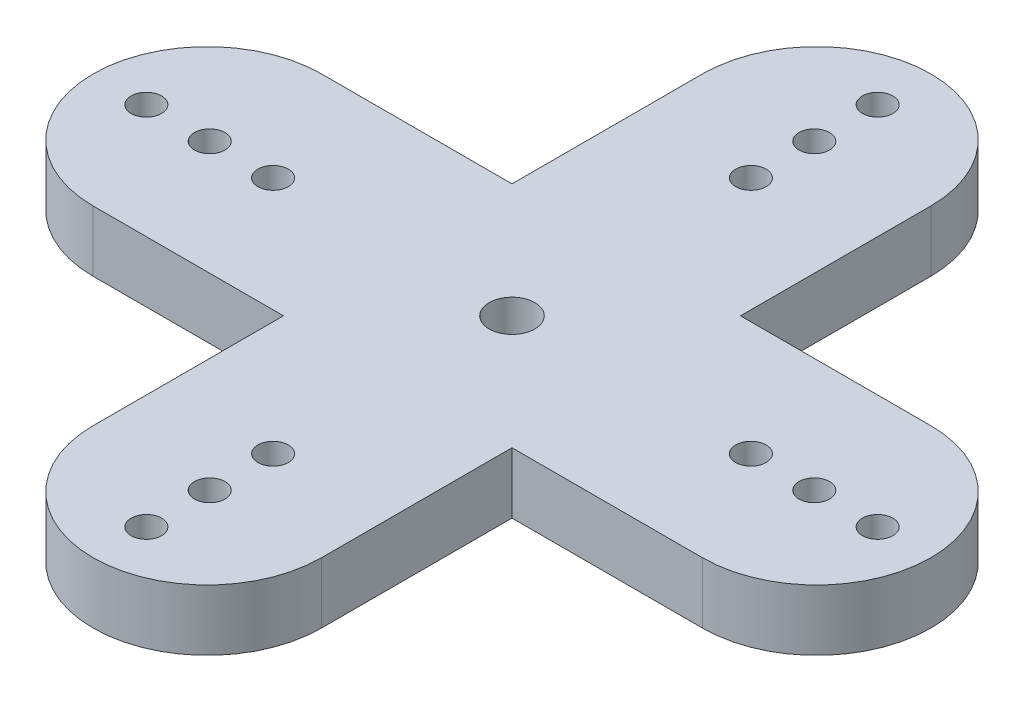
ISO-10303-21;
HEADER;
FILE_DESCRIPTION(('STEP AP214'),'2;1');
FILE_NAME('part.step','',(''),(''),'','','');
FILE_SCHEMA(('AUTOMOTIVE_DESIGN { 1 0 10303 214 1 1 1 1 }'));
ENDSEC;
DATA;
#1=APPLICATION_CONTEXT('core data for automotive mechanical design processes');
#2=APPLICATION_PROTOCOL_DEFINITION('international standard','automotive_design',2000,#1);
#3=PRODUCT_CONTEXT('',#1,'mechanical');
#4=PRODUCT('Part','Part','',(#3));
#5=PRODUCT_RELATED_PRODUCT_CATEGORY('part','',(#4));
#6=PRODUCT_DEFINITION_FORMATION('','',#4);
#7=PRODUCT_DEFINITION_CONTEXT('part definition',#1,'design');
#8=PRODUCT_DEFINITION('design','',#6,#7);
#9=PRODUCT_DEFINITION_SHAPE('','',#8);
#10=(LENGTH_UNIT() NAMED_UNIT(*) SI_UNIT(.MILLI.,.METRE.));
#11=(NAMED_UNIT(*) PLANE_ANGLE_UNIT() SI_UNIT($,.RADIAN.));
#12=(NAMED_UNIT(*) SI_UNIT($,.STERADIAN.) SOLID_ANGLE_UNIT());
#13=UNCERTAINTY_MEASURE_WITH_UNIT(LENGTH_MEASURE(1.E-05),#10,'distance_accuracy_value','');
#14=(GEOMETRIC_REPRESENTATION_CONTEXT(3) GLOBAL_UNCERTAINTY_ASSIGNED_CONTEXT((#13)) GLOBAL_UNIT_ASSIGNED_CONTEXT((#10,
#11,#12)) REPRESENTATION_CONTEXT('',''));
#15=CARTESIAN_POINT('',(0.,0.,0.));
#16=DIRECTION('',(0.,0.,1.));
#17=DIRECTION('',(1.,0.,0.));
#18=AXIS2_PLACEMENT_3D('',#15,#16,#17);
#19=CARTESIAN_POINT('',(0.,3.175,-15.875));
#20=DIRECTION('',(0.,-1.,0.));
#21=DIRECTION('',(0.,0.,-1.));
#22=AXIS2_PLACEMENT_3D('',#19,#20,#21);
#23=PLANE('',#22);
#24=CARTESIAN_POINT('',(-1.64951544372305E-13,3.175,15.748));
#25=DIRECTION('',(0.,1.,0.));
#26=DIRECTION('',(0.,0.,1.));
#27=AXIS2_PLACEMENT_3D('',#24,#25,#26);
#28=CIRCLE('',#27,0.793749999999999);
#29=CARTESIAN_POINT('',(-1.64951544372305E-13,3.175,16.54175));
#30=VERTEX_POINT('',#29);
#31=EDGE_CURVE('E326',#30,#30,#28,.T.);
#32=ORIENTED_EDGE('',*,*,#31,.F.);
#33=EDGE_LOOP('',(#32));
#34=FACE_BOUND('',#33,.T.);
#35=CARTESIAN_POINT('',(12.446,3.175,0.));
#36=DIRECTION('',(0.,1.,0.));
#37=DIRECTION('',(0.,0.,1.));
#38=AXIS2_PLACEMENT_3D('',#35,#36,#37);
#39=CIRCLE('',#38,0.79375);
#40=CARTESIAN_POINT('',(12.446,3.175,0.793750000000087));
#41=VERTEX_POINT('',#40);
#42=EDGE_CURVE('E338',#41,#41,#39,.T.);
#43=ORIENTED_EDGE('',*,*,#42,.F.);
#44=EDGE_LOOP('',(#43));
#45=FACE_BOUND('',#44,.T.);
#46=CARTESIAN_POINT('',(19.05,3.175,1.33025439009923E-13));
#47=DIRECTION('',(0.,1.,0.));
#48=DIRECTION('',(0.,0.,1.));
#49=AXIS2_PLACEMENT_3D('',#46,#47,#48);
#50=CIRCLE('',#49,0.793749999999998);
#51=CARTESIAN_POINT('',(19.05,3.175,0.793750000000131));
#52=VERTEX_POINT('',#51);
#53=EDGE_CURVE('E350',#52,#52,#50,.T.);
#54=ORIENTED_EDGE('',*,*,#53,.F.);
#55=EDGE_LOOP('',(#54));
#56=FACE_BOUND('',#55,.T.);
#57=CARTESIAN_POINT('',(0.,3.175,-15.748));
#58=DIRECTION('',(0.,1.,0.));
#59=DIRECTION('',(0.,0.,1.));
#60=AXIS2_PLACEMENT_3D('',#57,#58,#59);
#61=CIRCLE('',#60,0.793749999999999);
#62=CARTESIAN_POINT('',(0.,3.175,-14.95425));
#63=VERTEX_POINT('',#62);
#64=EDGE_CURVE('E362',#63,#63,#61,.T.);
#65=ORIENTED_EDGE('',*,*,#64,.F.);
#66=EDGE_LOOP('',(#65));
#67=FACE_BOUND('',#66,.T.);
#68=CARTESIAN_POINT('',(-12.446,3.175,0.));
#69=DIRECTION('',(0.,1.,0.));
#70=DIRECTION('',(0.,0.,1.));
#71=AXIS2_PLACEMENT_3D('',#68,#69,#70);
#72=CIRCLE('',#71,0.793749999999999);
#73=CARTESIAN_POINT('',(-12.446,3.175,0.793749999999999));
#74=VERTEX_POINT('',#73);
#75=EDGE_CURVE('E374',#74,#74,#72,.T.);
#76=ORIENTED_EDGE('',*,*,#75,.F.);
#77=EDGE_LOOP('',(#76));
#78=FACE_BOUND('',#77,.T.);
#79=CARTESIAN_POINT('',(0.,3.175,0.));
#80=DIRECTION('',(0.,1.,0.));
#81=DIRECTION('',(0.,0.,1.));
#82=AXIS2_PLACEMENT_3D('',#79,#80,#81);
#83=CIRCLE('',#82,1.190625);
#84=CARTESIAN_POINT('',(0.,3.175,1.190625));
#85=VERTEX_POINT('',#84);
#86=EDGE_CURVE('E386',#85,#85,#83,.T.);
#87=ORIENTED_EDGE('',*,*,#86,.F.);
#88=EDGE_LOOP('',(#87));
#89=FACE_BOUND('',#88,.T.);
#90=CARTESIAN_POINT('',(0.,3.175,-15.875));
#91=DIRECTION('',(0.,1.,0.));
#92=DIRECTION('',(0.,0.,-1.));
#93=AXIS2_PLACEMENT_3D('',#90,#91,#92);
#94=CIRCLE('',#93,5.953125);
#95=CARTESIAN_POINT('',(5.953125,3.175,-15.875));
#96=VERTEX_POINT('',#95);
#97=CARTESIAN_POINT('',(-5.953125,3.175,-15.875));
#98=VERTEX_POINT('',#97);
#99=EDGE_CURVE('E175',#96,#98,#94,.T.);
#100=ORIENTED_EDGE('',*,*,#99,.T.);
#101=DIRECTION('',(0.,0.,1.));
#102=VECTOR('',#101,1.);
#103=CARTESIAN_POINT('',(-5.953125,3.175,-15.875));
#104=LINE('',#103,#102);
#105=CARTESIAN_POINT('',(-5.953125,3.175,-5.95212500000002));
#106=VERTEX_POINT('',#105);
#107=EDGE_CURVE('E103',#98,#106,#104,.T.);
#108=ORIENTED_EDGE('',*,*,#107,.T.);
#109=DIRECTION('',(-1.,0.,0.));
#110=VECTOR('',#109,1.);
#111=CARTESIAN_POINT('',(-5.953125,3.175,-5.95212500000002));
#112=LINE('',#111,#110);
#113=CARTESIAN_POINT('',(-15.874,3.175,-5.95212500000006));
#114=VERTEX_POINT('',#113);
#115=EDGE_CURVE('E202',#106,#114,#112,.T.);
#116=ORIENTED_EDGE('',*,*,#115,.T.);
#117=CARTESIAN_POINT('',(-15.874,3.175,0.000999999999942813));
#118=DIRECTION('',(0.,1.,0.));
#119=DIRECTION('',(0.,0.,1.));
#120=AXIS2_PLACEMENT_3D('',#117,#118,#119);
#121=CIRCLE('',#120,5.953125);
#122=CARTESIAN_POINT('',(-15.874,3.175,5.95412499999994));
#123=VERTEX_POINT('',#122);
#124=EDGE_CURVE('E221',#114,#123,#121,.T.);
#125=ORIENTED_EDGE('',*,*,#124,.T.);
#126=DIRECTION('',(1.,0.,0.));
#127=VECTOR('',#126,1.);
#128=CARTESIAN_POINT('',(-5.953125,3.175,5.95412499999998));
#129=LINE('',#128,#127);
#130=CARTESIAN_POINT('',(-5.953125,3.175,5.95412499999998));
#131=VERTEX_POINT('',#130);
#132=EDGE_CURVE('E218',#123,#131,#129,.T.);
#133=ORIENTED_EDGE('',*,*,#132,.T.);
#134=DIRECTION('',(0.,0.,1.));
#135=VECTOR('',#134,1.);
#136=CARTESIAN_POINT('',(-5.953125,3.175,5.95412499999998));
#137=LINE('',#136,#135);
#138=CARTESIAN_POINT('',(-5.953125,3.175,15.875));
#139=VERTEX_POINT('',#138);
#140=EDGE_CURVE('E220',#131,#139,#137,.T.);
#141=ORIENTED_EDGE('',*,*,#140,.T.);
#142=CARTESIAN_POINT('',(0.,3.175,15.875));
#143=DIRECTION('',(0.,1.,0.));
#144=DIRECTION('',(0.,0.,1.));
#145=AXIS2_PLACEMENT_3D('',#142,#143,#144);
#146=CIRCLE('',#145,5.953125);
#147=CARTESIAN_POINT('',(5.953125,3.175,15.875));
#148=VERTEX_POINT('',#147);
#149=EDGE_CURVE('E223',#139,#148,#146,.T.);
#150=ORIENTED_EDGE('',*,*,#149,.T.);
#151=DIRECTION('',(0.,0.,-1.));
#152=VECTOR('',#151,1.);
#153=CARTESIAN_POINT('',(5.953125,3.175,5.95412500000002));
#154=LINE('',#153,#152);
#155=CARTESIAN_POINT('',(5.953125,3.175,5.95412500000002));
#156=VERTEX_POINT('',#155);
#157=EDGE_CURVE('E229',#148,#156,#154,.T.);
#158=ORIENTED_EDGE('',*,*,#157,.T.);
#159=DIRECTION('',(1.,0.,0.));
#160=VECTOR('',#159,1.);
#161=CARTESIAN_POINT('',(15.876,3.175,5.95412500000006));
#162=LINE('',#161,#160);
#163=CARTESIAN_POINT('',(15.876,3.175,5.95412500000006));
#164=VERTEX_POINT('',#163);
#165=EDGE_CURVE('E134',#156,#164,#162,.T.);
#166=ORIENTED_EDGE('',*,*,#165,.T.);
#167=CARTESIAN_POINT('',(15.876,3.175,0.00100000000005367));
#168=DIRECTION('',(0.,1.,0.));
#169=DIRECTION('',(0.,0.,-1.));
#170=AXIS2_PLACEMENT_3D('',#167,#168,#169);
#171=CIRCLE('',#170,5.953125);
#172=CARTESIAN_POINT('',(15.876,3.175,-5.95212499999995));
#173=VERTEX_POINT('',#172);
#174=EDGE_CURVE('E128',#164,#173,#171,.T.);
#175=ORIENTED_EDGE('',*,*,#174,.T.);
#176=DIRECTION('',(-1.,0.,0.));
#177=VECTOR('',#176,1.);
#178=CARTESIAN_POINT('',(15.876,3.175,-5.95212499999995));
#179=LINE('',#178,#177);
#180=CARTESIAN_POINT('',(5.953125,3.175,-5.95212499999998));
#181=VERTEX_POINT('',#180);
#182=EDGE_CURVE('E132',#173,#181,#179,.T.);
#183=ORIENTED_EDGE('',*,*,#182,.T.);
#184=DIRECTION('',(0.,0.,-1.));
#185=VECTOR('',#184,1.);
#186=CARTESIAN_POINT('',(5.953125,3.175,-15.875));
#187=LINE('',#186,#185);
#188=EDGE_CURVE('E48',#181,#96,#187,.T.);
#189=ORIENTED_EDGE('',*,*,#188,.T.);
#190=EDGE_LOOP('',(#100,#108,#116,#125,#133,#141,#150,#158,#166,#175,#183,#189));
#191=FACE_BOUND('',#190,.T.);
#192=CARTESIAN_POINT('',(-19.05,3.175,0.));
#193=DIRECTION('',(0.,1.,0.));
#194=DIRECTION('',(0.,0.,1.));
#195=AXIS2_PLACEMENT_3D('',#192,#193,#194);
#196=CIRCLE('',#195,0.793749999999999);
#197=CARTESIAN_POINT('',(-19.05,3.175,0.793749999999999));
#198=VERTEX_POINT('',#197);
#199=EDGE_CURVE('E156',#198,#198,#196,.T.);
#200=ORIENTED_EDGE('',*,*,#199,.F.);
#201=EDGE_LOOP('',(#200));
#202=FACE_BOUND('',#201,.T.);
#203=CARTESIAN_POINT('',(-15.748,3.175,0.));
#204=DIRECTION('',(0.,1.,0.));
#205=DIRECTION('',(0.,0.,1.));
#206=AXIS2_PLACEMENT_3D('',#203,#204,#205);
#207=CIRCLE('',#206,0.793749999999999);
#208=CARTESIAN_POINT('',(-15.748,3.175,0.793749999999999));
#209=VERTEX_POINT('',#208);
#210=EDGE_CURVE('E380',#209,#209,#207,.T.);
#211=ORIENTED_EDGE('',*,*,#210,.F.);
#212=EDGE_LOOP('',(#211));
#213=FACE_BOUND('',#212,.T.);
#214=CARTESIAN_POINT('',(0.,3.175,-19.05));
#215=DIRECTION('',(0.,1.,0.));
#216=DIRECTION('',(0.,0.,1.));
#217=AXIS2_PLACEMENT_3D('',#214,#215,#216);
#218=CIRCLE('',#217,0.793749999999999);
#219=CARTESIAN_POINT('',(0.,3.175,-18.25625));
#220=VERTEX_POINT('',#219);
#221=EDGE_CURVE('E368',#220,#220,#218,.T.);
#222=ORIENTED_EDGE('',*,*,#221,.F.);
#223=EDGE_LOOP('',(#222));
#224=FACE_BOUND('',#223,.T.);
#225=CARTESIAN_POINT('',(0.,3.175,-12.446));
#226=DIRECTION('',(0.,1.,0.));
#227=DIRECTION('',(0.,0.,1.));
#228=AXIS2_PLACEMENT_3D('',#225,#226,#227);
#229=CIRCLE('',#228,0.793749999999999);
#230=CARTESIAN_POINT('',(0.,3.175,-11.65225));
#231=VERTEX_POINT('',#230);
#232=EDGE_CURVE('E356',#231,#231,#229,.T.);
#233=ORIENTED_EDGE('',*,*,#232,.F.);
#234=EDGE_LOOP('',(#233));
#235=FACE_BOUND('',#234,.T.);
#236=CARTESIAN_POINT('',(15.748,3.175,1.09967696248203E-13));
#237=DIRECTION('',(0.,1.,0.));
#238=DIRECTION('',(0.,0.,1.));
#239=AXIS2_PLACEMENT_3D('',#236,#237,#238);
#240=CIRCLE('',#239,0.79375);
#241=CARTESIAN_POINT('',(15.748,3.175,0.79375000000011));
#242=VERTEX_POINT('',#241);
#243=EDGE_CURVE('E344',#242,#242,#240,.T.);
#244=ORIENTED_EDGE('',*,*,#243,.F.);
#245=EDGE_LOOP('',(#244));
#246=FACE_BOUND('',#245,.T.);
#247=CARTESIAN_POINT('',(-1.99538158514885E-13,3.175,19.05));
#248=DIRECTION('',(0.,1.,0.));
#249=DIRECTION('',(0.,0.,1.));
#250=AXIS2_PLACEMENT_3D('',#247,#248,#249);
#251=CIRCLE('',#250,0.79375);
#252=CARTESIAN_POINT('',(-1.99538158514885E-13,3.175,19.84375));
#253=VERTEX_POINT('',#252);
#254=EDGE_CURVE('E332',#253,#253,#251,.T.);
#255=ORIENTED_EDGE('',*,*,#254,.F.);
#256=EDGE_LOOP('',(#255));
#257=FACE_BOUND('',#256,.T.);
#258=CARTESIAN_POINT('',(-1.30364930229725E-13,3.175,12.446));
#259=DIRECTION('',(0.,1.,0.));
#260=DIRECTION('',(0.,0.,1.));
#261=AXIS2_PLACEMENT_3D('',#258,#259,#260);
#262=CIRCLE('',#261,0.793749999999999);
#263=CARTESIAN_POINT('',(-1.30364930229725E-13,3.175,13.23975));
#264=VERTEX_POINT('',#263);
#265=EDGE_CURVE('E317',#264,#264,#262,.T.);
#266=ORIENTED_EDGE('',*,*,#265,.F.);
#267=EDGE_LOOP('',(#266));
#268=FACE_BOUND('',#267,.T.);
#269=ADVANCED_FACE('F31',(#34,#45,#56,#67,#78,#89,#191,#202,#213,#224,#235,#246,#257,#268),#23,.F.);
#270=CARTESIAN_POINT('',(0.,0.,-15.875));
#271=DIRECTION('',(0.,-1.,0.));
#272=DIRECTION('',(0.,0.,-1.));
#273=AXIS2_PLACEMENT_3D('',#270,#271,#272);
#274=PLANE('',#273);
#275=CARTESIAN_POINT('',(-1.64951544372305E-13,0.,15.748));
#276=DIRECTION('',(0.,1.,0.));
#277=DIRECTION('',(0.,0.,1.));
#278=AXIS2_PLACEMENT_3D('',#275,#276,#277);
#279=CIRCLE('',#278,0.793749999999999);
#280=CARTESIAN_POINT('',(-1.64951544372305E-13,0.,16.54175));
#281=VERTEX_POINT('',#280);
#282=EDGE_CURVE('E323',#281,#281,#279,.T.);
#283=ORIENTED_EDGE('',*,*,#282,.T.);
#284=EDGE_LOOP('',(#283));
#285=FACE_BOUND('',#284,.T.);
#286=CARTESIAN_POINT('',(12.446,0.,0.));
#287=DIRECTION('',(0.,1.,0.));
#288=DIRECTION('',(0.,0.,1.));
#289=AXIS2_PLACEMENT_3D('',#286,#287,#288);
#290=CIRCLE('',#289,0.79375);
#291=CARTESIAN_POINT('',(12.446,0.,0.793750000000087));
#292=VERTEX_POINT('',#291);
#293=EDGE_CURVE('E335',#292,#292,#290,.T.);
#294=ORIENTED_EDGE('',*,*,#293,.T.);
#295=EDGE_LOOP('',(#294));
#296=FACE_BOUND('',#295,.T.);
#297=CARTESIAN_POINT('',(19.05,0.,1.33025439009923E-13));
#298=DIRECTION('',(0.,1.,0.));
#299=DIRECTION('',(0.,0.,1.));
#300=AXIS2_PLACEMENT_3D('',#297,#298,#299);
#301=CIRCLE('',#300,0.793749999999998);
#302=CARTESIAN_POINT('',(19.05,0.,0.793750000000131));
#303=VERTEX_POINT('',#302);
#304=EDGE_CURVE('E347',#303,#303,#301,.T.);
#305=ORIENTED_EDGE('',*,*,#304,.T.);
#306=EDGE_LOOP('',(#305));
#307=FACE_BOUND('',#306,.T.);
#308=CARTESIAN_POINT('',(0.,0.,-15.748));
#309=DIRECTION('',(0.,1.,0.));
#310=DIRECTION('',(0.,0.,1.));
#311=AXIS2_PLACEMENT_3D('',#308,#309,#310);
#312=CIRCLE('',#311,0.793749999999999);
#313=CARTESIAN_POINT('',(0.,0.,-14.95425));
#314=VERTEX_POINT('',#313);
#315=EDGE_CURVE('E359',#314,#314,#312,.T.);
#316=ORIENTED_EDGE('',*,*,#315,.T.);
#317=EDGE_LOOP('',(#316));
#318=FACE_BOUND('',#317,.T.);
#319=CARTESIAN_POINT('',(-12.446,0.,0.));
#320=DIRECTION('',(0.,1.,0.));
#321=DIRECTION('',(0.,0.,1.));
#322=AXIS2_PLACEMENT_3D('',#319,#320,#321);
#323=CIRCLE('',#322,0.793749999999999);
#324=CARTESIAN_POINT('',(-12.446,0.,0.793749999999999));
#325=VERTEX_POINT('',#324);
#326=EDGE_CURVE('E371',#325,#325,#323,.T.);
#327=ORIENTED_EDGE('',*,*,#326,.T.);
#328=EDGE_LOOP('',(#327));
#329=FACE_BOUND('',#328,.T.);
#330=CARTESIAN_POINT('',(0.,0.,0.));
#331=DIRECTION('',(0.,1.,0.));
#332=DIRECTION('',(0.,0.,1.));
#333=AXIS2_PLACEMENT_3D('',#330,#331,#332);
#334=CIRCLE('',#333,1.190625);
#335=CARTESIAN_POINT('',(0.,0.,1.190625));
#336=VERTEX_POINT('',#335);
#337=EDGE_CURVE('E383',#336,#336,#334,.T.);
#338=ORIENTED_EDGE('',*,*,#337,.T.);
#339=EDGE_LOOP('',(#338));
#340=FACE_BOUND('',#339,.T.);
#341=CARTESIAN_POINT('',(0.,0.,-15.875));
#342=DIRECTION('',(0.,1.,0.));
#343=DIRECTION('',(0.,0.,-1.));
#344=AXIS2_PLACEMENT_3D('',#341,#342,#343);
#345=CIRCLE('',#344,5.953125);
#346=CARTESIAN_POINT('',(5.953125,0.,-15.875));
#347=VERTEX_POINT('',#346);
#348=CARTESIAN_POINT('',(-5.953125,0.,-15.875));
#349=VERTEX_POINT('',#348);
#350=EDGE_CURVE('E152',#347,#349,#345,.T.);
#351=ORIENTED_EDGE('',*,*,#350,.F.);
#352=DIRECTION('',(0.,0.,-1.));
#353=VECTOR('',#352,1.);
#354=CARTESIAN_POINT('',(5.953125,0.,-15.875));
#355=LINE('',#354,#353);
#356=CARTESIAN_POINT('',(5.953125,0.,-5.95212499999998));
#357=VERTEX_POINT('',#356);
#358=EDGE_CURVE('E95',#357,#347,#355,.T.);
#359=ORIENTED_EDGE('',*,*,#358,.F.);
#360=DIRECTION('',(-1.,0.,0.));
#361=VECTOR('',#360,1.);
#362=CARTESIAN_POINT('',(15.876,0.,-5.95212499999995));
#363=LINE('',#362,#361);
#364=CARTESIAN_POINT('',(15.876,0.,-5.95212499999995));
#365=VERTEX_POINT('',#364);
#366=EDGE_CURVE('E89',#365,#357,#363,.T.);
#367=ORIENTED_EDGE('',*,*,#366,.F.);
#368=CARTESIAN_POINT('',(15.876,0.,0.00100000000005367));
#369=DIRECTION('',(0.,1.,0.));
#370=DIRECTION('',(0.,0.,-1.));
#371=AXIS2_PLACEMENT_3D('',#368,#369,#370);
#372=CIRCLE('',#371,5.953125);
#373=CARTESIAN_POINT('',(15.876,0.,5.95412500000006));
#374=VERTEX_POINT('',#373);
#375=EDGE_CURVE('E142',#374,#365,#372,.T.);
#376=ORIENTED_EDGE('',*,*,#375,.F.);
#377=DIRECTION('',(1.,0.,0.));
#378=VECTOR('',#377,1.);
#379=CARTESIAN_POINT('',(15.876,0.,5.95412500000006));
#380=LINE('',#379,#378);
#381=CARTESIAN_POINT('',(5.953125,0.,5.95412500000002));
#382=VERTEX_POINT('',#381);
#383=EDGE_CURVE('E170',#382,#374,#380,.T.);
#384=ORIENTED_EDGE('',*,*,#383,.F.);
#385=DIRECTION('',(0.,0.,-1.));
#386=VECTOR('',#385,1.);
#387=CARTESIAN_POINT('',(5.953125,0.,5.95412500000002));
#388=LINE('',#387,#386);
#389=CARTESIAN_POINT('',(5.953125,0.,15.875));
#390=VERTEX_POINT('',#389);
#391=EDGE_CURVE('E168',#390,#382,#388,.T.);
#392=ORIENTED_EDGE('',*,*,#391,.F.);
#393=CARTESIAN_POINT('',(0.,0.,15.875));
#394=DIRECTION('',(0.,1.,0.));
#395=DIRECTION('',(0.,0.,1.));
#396=AXIS2_PLACEMENT_3D('',#393,#394,#395);
#397=CIRCLE('',#396,5.953125);
#398=CARTESIAN_POINT('',(-5.953125,0.,15.875));
#399=VERTEX_POINT('',#398);
#400=EDGE_CURVE('E166',#399,#390,#397,.T.);
#401=ORIENTED_EDGE('',*,*,#400,.F.);
#402=DIRECTION('',(0.,0.,1.));
#403=VECTOR('',#402,1.);
#404=CARTESIAN_POINT('',(-5.953125,0.,5.95412499999998));
#405=LINE('',#404,#403);
#406=CARTESIAN_POINT('',(-5.953125,0.,5.95412499999998));
#407=VERTEX_POINT('',#406);
#408=EDGE_CURVE('E164',#407,#399,#405,.T.);
#409=ORIENTED_EDGE('',*,*,#408,.F.);
#410=DIRECTION('',(1.,0.,0.));
#411=VECTOR('',#410,1.);
#412=CARTESIAN_POINT('',(-5.953125,0.,5.95412499999998));
#413=LINE('',#412,#411);
#414=CARTESIAN_POINT('',(-15.874,0.,5.95412499999994));
#415=VERTEX_POINT('',#414);
#416=EDGE_CURVE('E162',#415,#407,#413,.T.);
#417=ORIENTED_EDGE('',*,*,#416,.F.);
#418=CARTESIAN_POINT('',(-15.874,0.,0.000999999999942813));
#419=DIRECTION('',(0.,1.,0.));
#420=DIRECTION('',(0.,0.,1.));
#421=AXIS2_PLACEMENT_3D('',#418,#419,#420);
#422=CIRCLE('',#421,5.953125);
#423=CARTESIAN_POINT('',(-15.874,0.,-5.95212500000006));
#424=VERTEX_POINT('',#423);
#425=EDGE_CURVE('E160',#424,#415,#422,.T.);
#426=ORIENTED_EDGE('',*,*,#425,.F.);
#427=DIRECTION('',(-1.,0.,0.));
#428=VECTOR('',#427,1.);
#429=CARTESIAN_POINT('',(-5.953125,0.,-5.95212500000002));
#430=LINE('',#429,#428);
#431=CARTESIAN_POINT('',(-5.953125,0.,-5.95212500000002));
#432=VERTEX_POINT('',#431);
#433=EDGE_CURVE('E158',#432,#424,#430,.T.);
#434=ORIENTED_EDGE('',*,*,#433,.F.);
#435=DIRECTION('',(0.,0.,1.));
#436=VECTOR('',#435,1.);
#437=CARTESIAN_POINT('',(-5.953125,0.,-15.875));
#438=LINE('',#437,#436);
#439=EDGE_CURVE('E155',#349,#432,#438,.T.);
#440=ORIENTED_EDGE('',*,*,#439,.F.);
#441=EDGE_LOOP('',(#351,#359,#367,#376,#384,#392,#401,#409,#417,#426,#434,#440));
#442=FACE_BOUND('',#441,.T.);
#443=CARTESIAN_POINT('',(-19.05,0.,0.));
#444=DIRECTION('',(0.,1.,0.));
#445=DIRECTION('',(0.,0.,1.));
#446=AXIS2_PLACEMENT_3D('',#443,#444,#445);
#447=CIRCLE('',#446,0.793749999999999);
#448=CARTESIAN_POINT('',(-19.05,0.,0.793749999999999));
#449=VERTEX_POINT('',#448);
#450=EDGE_CURVE('E389',#449,#449,#447,.T.);
#451=ORIENTED_EDGE('',*,*,#450,.T.);
#452=EDGE_LOOP('',(#451));
#453=FACE_BOUND('',#452,.T.);
#454=CARTESIAN_POINT('',(-15.748,0.,0.));
#455=DIRECTION('',(0.,1.,0.));
#456=DIRECTION('',(0.,0.,1.));
#457=AXIS2_PLACEMENT_3D('',#454,#455,#456);
#458=CIRCLE('',#457,0.793749999999999);
#459=CARTESIAN_POINT('',(-15.748,0.,0.793749999999999));
#460=VERTEX_POINT('',#459);
#461=EDGE_CURVE('E377',#460,#460,#458,.T.);
#462=ORIENTED_EDGE('',*,*,#461,.T.);
#463=EDGE_LOOP('',(#462));
#464=FACE_BOUND('',#463,.T.);
#465=CARTESIAN_POINT('',(0.,0.,-19.05));
#466=DIRECTION('',(0.,1.,0.));
#467=DIRECTION('',(0.,0.,1.));
#468=AXIS2_PLACEMENT_3D('',#465,#466,#467);
#469=CIRCLE('',#468,0.793749999999999);
#470=CARTESIAN_POINT('',(0.,0.,-18.25625));
#471=VERTEX_POINT('',#470);
#472=EDGE_CURVE('E365',#471,#471,#469,.T.);
#473=ORIENTED_EDGE('',*,*,#472,.T.);
#474=EDGE_LOOP('',(#473));
#475=FACE_BOUND('',#474,.T.);
#476=CARTESIAN_POINT('',(0.,0.,-12.446));
#477=DIRECTION('',(0.,1.,0.));
#478=DIRECTION('',(0.,0.,1.));
#479=AXIS2_PLACEMENT_3D('',#476,#477,#478);
#480=CIRCLE('',#479,0.793749999999999);
#481=CARTESIAN_POINT('',(0.,0.,-11.65225));
#482=VERTEX_POINT('',#481);
#483=EDGE_CURVE('E353',#482,#482,#480,.T.);
#484=ORIENTED_EDGE('',*,*,#483,.T.);
#485=EDGE_LOOP('',(#484));
#486=FACE_BOUND('',#485,.T.);
#487=CARTESIAN_POINT('',(15.748,0.,1.09967696248203E-13));
#488=DIRECTION('',(0.,1.,0.));
#489=DIRECTION('',(0.,0.,1.));
#490=AXIS2_PLACEMENT_3D('',#487,#488,#489);
#491=CIRCLE('',#490,0.79375);
#492=CARTESIAN_POINT('',(15.748,0.,0.79375000000011));
#493=VERTEX_POINT('',#492);
#494=EDGE_CURVE('E341',#493,#493,#491,.T.);
#495=ORIENTED_EDGE('',*,*,#494,.T.);
#496=EDGE_LOOP('',(#495));
#497=FACE_BOUND('',#496,.T.);
#498=CARTESIAN_POINT('',(-1.99538158514885E-13,0.,19.05));
#499=DIRECTION('',(0.,1.,0.));
#500=DIRECTION('',(0.,0.,1.));
#501=AXIS2_PLACEMENT_3D('',#498,#499,#500);
#502=CIRCLE('',#501,0.79375);
#503=CARTESIAN_POINT('',(-1.99538158514885E-13,0.,19.84375));
#504=VERTEX_POINT('',#503);
#505=EDGE_CURVE('E329',#504,#504,#502,.T.);
#506=ORIENTED_EDGE('',*,*,#505,.T.);
#507=EDGE_LOOP('',(#506));
#508=FACE_BOUND('',#507,.T.);
#509=CARTESIAN_POINT('',(-1.30364930229725E-13,0.,12.446));
#510=DIRECTION('',(0.,1.,0.));
#511=DIRECTION('',(0.,0.,1.));
#512=AXIS2_PLACEMENT_3D('',#509,#510,#511);
#513=CIRCLE('',#512,0.793749999999999);
#514=CARTESIAN_POINT('',(-1.30364930229725E-13,0.,13.23975));
#515=VERTEX_POINT('',#514);
#516=EDGE_CURVE('E320',#515,#515,#513,.T.);
#517=ORIENTED_EDGE('',*,*,#516,.T.);
#518=EDGE_LOOP('',(#517));
#519=FACE_BOUND('',#518,.T.);
#520=ADVANCED_FACE('F206',(#285,#296,#307,#318,#329,#340,#442,#453,#464,#475,#486,#497,#508,
#519),#274,.T.);
#521=CARTESIAN_POINT('',(0.,3.175,-15.875));
#522=DIRECTION('',(0.,-1.,0.));
#523=DIRECTION('',(0.,0.,-1.));
#524=AXIS2_PLACEMENT_3D('',#521,#522,#523);
#525=CYLINDRICAL_SURFACE('',#524,5.953125);
#526=ORIENTED_EDGE('',*,*,#350,.T.);
#527=DIRECTION('',(0.,-1.,0.));
#528=VECTOR('',#527,1.);
#529=CARTESIAN_POINT('',(-5.953125,3.175,-15.875));
#530=LINE('',#529,#528);
#531=EDGE_CURVE('E11',#98,#349,#530,.T.);
#532=ORIENTED_EDGE('',*,*,#531,.F.);
#533=ORIENTED_EDGE('',*,*,#99,.F.);
#534=DIRECTION('',(0.,-1.,0.));
#535=VECTOR('',#534,1.);
#536=CARTESIAN_POINT('',(5.953125,3.175,-15.875));
#537=LINE('',#536,#535);
#538=EDGE_CURVE('E148',#96,#347,#537,.T.);
#539=ORIENTED_EDGE('',*,*,#538,.T.);
#540=EDGE_LOOP('',(#526,#532,#533,#539));
#541=FACE_BOUND('',#540,.T.);
#542=ADVANCED_FACE('F33',(#541),#525,.T.);
#543=CARTESIAN_POINT('',(-5.953125,3.175,-15.875));
#544=DIRECTION('',(1.,0.,0.));
#545=DIRECTION('',(0.,0.,-1.));
#546=AXIS2_PLACEMENT_3D('',#543,#544,#545);
#547=PLANE('',#546);
#548=ORIENTED_EDGE('',*,*,#439,.T.);
#549=DIRECTION('',(0.,-1.,0.));
#550=VECTOR('',#549,1.);
#551=CARTESIAN_POINT('',(-5.953125,3.175,-5.95212500000002));
#552=LINE('',#551,#550);
#553=EDGE_CURVE('E40',#106,#432,#552,.T.);
#554=ORIENTED_EDGE('',*,*,#553,.F.);
#555=ORIENTED_EDGE('',*,*,#107,.F.);
#556=ORIENTED_EDGE('',*,*,#531,.T.);
#557=EDGE_LOOP('',(#548,#554,#555,#556));
#558=FACE_BOUND('',#557,.T.);
#559=ADVANCED_FACE('F579',(#558),#547,.F.);
#560=CARTESIAN_POINT('',(-5.953125,3.175,-5.95212500000002));
#561=DIRECTION('',(0.,0.,1.));
#562=DIRECTION('',(1.,0.,0.));
#563=AXIS2_PLACEMENT_3D('',#560,#561,#562);
#564=PLANE('',#563);
#565=ORIENTED_EDGE('',*,*,#433,.T.);
#566=DIRECTION('',(0.,-1.,0.));
#567=VECTOR('',#566,1.);
#568=CARTESIAN_POINT('',(-15.874,3.175,-5.95212500000006));
#569=LINE('',#568,#567);
#570=EDGE_CURVE('E194',#114,#424,#569,.T.);
#571=ORIENTED_EDGE('',*,*,#570,.F.);
#572=ORIENTED_EDGE('',*,*,#115,.F.);
#573=ORIENTED_EDGE('',*,*,#553,.T.);
#574=EDGE_LOOP('',(#565,#571,#572,#573));
#575=FACE_BOUND('',#574,.T.);
#576=ADVANCED_FACE('F200',(#575),#564,.F.);
#577=CARTESIAN_POINT('',(-15.874,3.175,0.000999999999942813));
#578=DIRECTION('',(0.,-1.,0.));
#579=DIRECTION('',(0.,0.,-1.));
#580=AXIS2_PLACEMENT_3D('',#577,#578,#579);
#581=CYLINDRICAL_SURFACE('',#580,5.953125);
#582=ORIENTED_EDGE('',*,*,#425,.T.);
#583=DIRECTION('',(0.,-1.,0.));
#584=VECTOR('',#583,1.);
#585=CARTESIAN_POINT('',(-15.874,3.175,5.95412499999994));
#586=LINE('',#585,#584);
#587=EDGE_CURVE('E191',#123,#415,#586,.T.);
#588=ORIENTED_EDGE('',*,*,#587,.F.);
#589=ORIENTED_EDGE('',*,*,#124,.F.);
#590=ORIENTED_EDGE('',*,*,#570,.T.);
#591=EDGE_LOOP('',(#582,#588,#589,#590));
#592=FACE_BOUND('',#591,.T.);
#593=ADVANCED_FACE('F212',(#592),#581,.T.);
#594=CARTESIAN_POINT('',(-5.953125,3.175,5.95412499999998));
#595=DIRECTION('',(0.,0.,-1.));
#596=DIRECTION('',(-1.,0.,0.));
#597=AXIS2_PLACEMENT_3D('',#594,#595,#596);
#598=PLANE('',#597);
#599=ORIENTED_EDGE('',*,*,#416,.T.);
#600=DIRECTION('',(0.,-1.,0.));
#601=VECTOR('',#600,1.);
#602=CARTESIAN_POINT('',(-5.953125,3.175,5.95412499999998));
#603=LINE('',#602,#601);
#604=EDGE_CURVE('E188',#131,#407,#603,.T.);
#605=ORIENTED_EDGE('',*,*,#604,.F.);
#606=ORIENTED_EDGE('',*,*,#132,.F.);
#607=ORIENTED_EDGE('',*,*,#587,.T.);
#608=EDGE_LOOP('',(#599,#605,#606,#607));
#609=FACE_BOUND('',#608,.T.);
#610=ADVANCED_FACE('F216',(#609),#598,.F.);
#611=CARTESIAN_POINT('',(-5.953125,3.175,5.95412499999998));
#612=DIRECTION('',(1.,0.,0.));
#613=DIRECTION('',(0.,0.,-1.));
#614=AXIS2_PLACEMENT_3D('',#611,#612,#613);
#615=PLANE('',#614);
#616=ORIENTED_EDGE('',*,*,#408,.T.);
#617=DIRECTION('',(0.,-1.,0.));
#618=VECTOR('',#617,1.);
#619=CARTESIAN_POINT('',(-5.953125,3.175,15.875));
#620=LINE('',#619,#618);
#621=EDGE_CURVE('E185',#139,#399,#620,.T.);
#622=ORIENTED_EDGE('',*,*,#621,.F.);
#623=ORIENTED_EDGE('',*,*,#140,.F.);
#624=ORIENTED_EDGE('',*,*,#604,.T.);
#625=EDGE_LOOP('',(#616,#622,#623,#624));
#626=FACE_BOUND('',#625,.T.);
#627=ADVANCED_FACE('F544',(#626),#615,.F.);
#628=CARTESIAN_POINT('',(0.,3.175,15.875));
#629=DIRECTION('',(0.,-1.,0.));
#630=DIRECTION('',(0.,0.,-1.));
#631=AXIS2_PLACEMENT_3D('',#628,#629,#630);
#632=CYLINDRICAL_SURFACE('',#631,5.953125);
#633=ORIENTED_EDGE('',*,*,#400,.T.);
#634=DIRECTION('',(0.,-1.,0.));
#635=VECTOR('',#634,1.);
#636=CARTESIAN_POINT('',(5.953125,3.175,15.875));
#637=LINE('',#636,#635);
#638=EDGE_CURVE('E182',#148,#390,#637,.T.);
#639=ORIENTED_EDGE('',*,*,#638,.F.);
#640=ORIENTED_EDGE('',*,*,#149,.F.);
#641=ORIENTED_EDGE('',*,*,#621,.T.);
#642=EDGE_LOOP('',(#633,#639,#640,#641));
#643=FACE_BOUND('',#642,.T.);
#644=ADVANCED_FACE('F535',(#643),#632,.T.);
#645=CARTESIAN_POINT('',(5.953125,3.175,5.95412500000002));
#646=DIRECTION('',(-1.,0.,0.));
#647=DIRECTION('',(0.,0.,1.));
#648=AXIS2_PLACEMENT_3D('',#645,#646,#647);
#649=PLANE('',#648);
#650=ORIENTED_EDGE('',*,*,#391,.T.);
#651=DIRECTION('',(0.,-1.,0.));
#652=VECTOR('',#651,1.);
#653=CARTESIAN_POINT('',(5.953125,3.175,5.95412500000002));
#654=LINE('',#653,#652);
#655=EDGE_CURVE('E179',#156,#382,#654,.T.);
#656=ORIENTED_EDGE('',*,*,#655,.F.);
#657=ORIENTED_EDGE('',*,*,#157,.F.);
#658=ORIENTED_EDGE('',*,*,#638,.T.);
#659=EDGE_LOOP('',(#650,#656,#657,#658));
#660=FACE_BOUND('',#659,.T.);
#661=ADVANCED_FACE('F235',(#660),#649,.F.);
#662=CARTESIAN_POINT('',(15.876,3.175,5.95412500000006));
#663=DIRECTION('',(0.,0.,-1.));
#664=DIRECTION('',(-1.,0.,0.));
#665=AXIS2_PLACEMENT_3D('',#662,#663,#664);
#666=PLANE('',#665);
#667=ORIENTED_EDGE('',*,*,#383,.T.);
#668=DIRECTION('',(0.,-1.,0.));
#669=VECTOR('',#668,1.);
#670=CARTESIAN_POINT('',(15.876,3.175,5.95412500000006));
#671=LINE('',#670,#669);
#672=EDGE_CURVE('E143',#164,#374,#671,.T.);
#673=ORIENTED_EDGE('',*,*,#672,.F.);
#674=ORIENTED_EDGE('',*,*,#165,.F.);
#675=ORIENTED_EDGE('',*,*,#655,.T.);
#676=EDGE_LOOP('',(#667,#673,#674,#675));
#677=FACE_BOUND('',#676,.T.);
#678=ADVANCED_FACE('F239',(#677),#666,.F.);
#679=CARTESIAN_POINT('',(15.876,3.175,0.00100000000005367));
#680=DIRECTION('',(0.,-1.,0.));
#681=DIRECTION('',(0.,0.,-1.));
#682=AXIS2_PLACEMENT_3D('',#679,#680,#681);
#683=CYLINDRICAL_SURFACE('',#682,5.953125);
#684=ORIENTED_EDGE('',*,*,#375,.T.);
#685=DIRECTION('',(0.,-1.,0.));
#686=VECTOR('',#685,1.);
#687=CARTESIAN_POINT('',(15.876,3.175,-5.95212499999995));
#688=LINE('',#687,#686);
#689=EDGE_CURVE('E139',#173,#365,#688,.T.);
#690=ORIENTED_EDGE('',*,*,#689,.F.);
#691=ORIENTED_EDGE('',*,*,#174,.F.);
#692=ORIENTED_EDGE('',*,*,#672,.T.);
#693=EDGE_LOOP('',(#684,#690,#691,#692));
#694=FACE_BOUND('',#693,.T.);
#695=ADVANCED_FACE('F140',(#694),#683,.T.);
#696=CARTESIAN_POINT('',(15.876,3.175,-5.95212499999995));
#697=DIRECTION('',(0.,0.,1.));
#698=DIRECTION('',(1.,0.,0.));
#699=AXIS2_PLACEMENT_3D('',#696,#697,#698);
#700=PLANE('',#699);
#701=ORIENTED_EDGE('',*,*,#366,.T.);
#702=DIRECTION('',(0.,-1.,0.));
#703=VECTOR('',#702,1.);
#704=CARTESIAN_POINT('',(5.953125,3.175,-5.95212499999998));
#705=LINE('',#704,#703);
#706=EDGE_CURVE('E144',#181,#357,#705,.T.);
#707=ORIENTED_EDGE('',*,*,#706,.F.);
#708=ORIENTED_EDGE('',*,*,#182,.F.);
#709=ORIENTED_EDGE('',*,*,#689,.T.);
#710=EDGE_LOOP('',(#701,#707,#708,#709));
#711=FACE_BOUND('',#710,.T.);
#712=ADVANCED_FACE('F146',(#711),#700,.F.);
#713=CARTESIAN_POINT('',(5.953125,3.175,-15.875));
#714=DIRECTION('',(-1.,0.,0.));
#715=DIRECTION('',(0.,0.,1.));
#716=AXIS2_PLACEMENT_3D('',#713,#714,#715);
#717=PLANE('',#716);
#718=ORIENTED_EDGE('',*,*,#358,.T.);
#719=ORIENTED_EDGE('',*,*,#538,.F.);
#720=ORIENTED_EDGE('',*,*,#188,.F.);
#721=ORIENTED_EDGE('',*,*,#706,.T.);
#722=EDGE_LOOP('',(#718,#719,#720,#721));
#723=FACE_BOUND('',#722,.T.);
#724=ADVANCED_FACE('F243',(#723),#717,.F.);
#725=CARTESIAN_POINT('',(-19.05,3.175,0.));
#726=DIRECTION('',(0.,-1.,0.));
#727=DIRECTION('',(0.,0.,-1.));
#728=AXIS2_PLACEMENT_3D('',#725,#726,#727);
#729=CYLINDRICAL_SURFACE('',#728,0.793749999999999);
#730=ORIENTED_EDGE('',*,*,#199,.T.);
#731=EDGE_LOOP('',(#730));
#732=FACE_BOUND('',#731,.T.);
#733=ORIENTED_EDGE('',*,*,#450,.F.);
#734=EDGE_LOOP('',(#733));
#735=FACE_BOUND('',#734,.T.);
#736=ADVANCED_FACE('F245',(#732,#735),#729,.F.);
#737=CARTESIAN_POINT('',(0.,3.175,0.));
#738=DIRECTION('',(0.,-1.,0.));
#739=DIRECTION('',(0.,0.,-1.));
#740=AXIS2_PLACEMENT_3D('',#737,#738,#739);
#741=CYLINDRICAL_SURFACE('',#740,1.190625);
#742=ORIENTED_EDGE('',*,*,#86,.T.);
#743=EDGE_LOOP('',(#742));
#744=FACE_BOUND('',#743,.T.);
#745=ORIENTED_EDGE('',*,*,#337,.F.);
#746=EDGE_LOOP('',(#745));
#747=FACE_BOUND('',#746,.T.);
#748=ADVANCED_FACE('F251',(#744,#747),#741,.F.);
#749=CARTESIAN_POINT('',(-15.748,3.175,0.));
#750=DIRECTION('',(0.,-1.,0.));
#751=DIRECTION('',(0.,0.,-1.));
#752=AXIS2_PLACEMENT_3D('',#749,#750,#751);
#753=CYLINDRICAL_SURFACE('',#752,0.793749999999999);
#754=ORIENTED_EDGE('',*,*,#210,.T.);
#755=EDGE_LOOP('',(#754));
#756=FACE_BOUND('',#755,.T.);
#757=ORIENTED_EDGE('',*,*,#461,.F.);
#758=EDGE_LOOP('',(#757));
#759=FACE_BOUND('',#758,.T.);
#760=ADVANCED_FACE('F268',(#756,#759),#753,.F.);
#761=CARTESIAN_POINT('',(-12.446,3.175,0.));
#762=DIRECTION('',(0.,-1.,0.));
#763=DIRECTION('',(0.,0.,-1.));
#764=AXIS2_PLACEMENT_3D('',#761,#762,#763);
#765=CYLINDRICAL_SURFACE('',#764,0.793749999999999);
#766=ORIENTED_EDGE('',*,*,#75,.T.);
#767=EDGE_LOOP('',(#766));
#768=FACE_BOUND('',#767,.T.);
#769=ORIENTED_EDGE('',*,*,#326,.F.);
#770=EDGE_LOOP('',(#769));
#771=FACE_BOUND('',#770,.T.);
#772=ADVANCED_FACE('F272',(#768,#771),#765,.F.);
#773=CARTESIAN_POINT('',(0.,3.175,-19.05));
#774=DIRECTION('',(0.,-1.,0.));
#775=DIRECTION('',(0.,0.,-1.));
#776=AXIS2_PLACEMENT_3D('',#773,#774,#775);
#777=CYLINDRICAL_SURFACE('',#776,0.793749999999999);
#778=ORIENTED_EDGE('',*,*,#221,.T.);
#779=EDGE_LOOP('',(#778));
#780=FACE_BOUND('',#779,.T.);
#781=ORIENTED_EDGE('',*,*,#472,.F.);
#782=EDGE_LOOP('',(#781));
#783=FACE_BOUND('',#782,.T.);
#784=ADVANCED_FACE('F276',(#780,#783),#777,.F.);
#785=CARTESIAN_POINT('',(0.,3.175,-15.748));
#786=DIRECTION('',(0.,-1.,0.));
#787=DIRECTION('',(0.,0.,-1.));
#788=AXIS2_PLACEMENT_3D('',#785,#786,#787);
#789=CYLINDRICAL_SURFACE('',#788,0.793749999999999);
#790=ORIENTED_EDGE('',*,*,#64,.T.);
#791=EDGE_LOOP('',(#790));
#792=FACE_BOUND('',#791,.T.);
#793=ORIENTED_EDGE('',*,*,#315,.F.);
#794=EDGE_LOOP('',(#793));
#795=FACE_BOUND('',#794,.T.);
#796=ADVANCED_FACE('F280',(#792,#795),#789,.F.);
#797=CARTESIAN_POINT('',(0.,3.175,-12.446));
#798=DIRECTION('',(0.,-1.,0.));
#799=DIRECTION('',(0.,0.,-1.));
#800=AXIS2_PLACEMENT_3D('',#797,#798,#799);
#801=CYLINDRICAL_SURFACE('',#800,0.793749999999999);
#802=ORIENTED_EDGE('',*,*,#232,.T.);
#803=EDGE_LOOP('',(#802));
#804=FACE_BOUND('',#803,.T.);
#805=ORIENTED_EDGE('',*,*,#483,.F.);
#806=EDGE_LOOP('',(#805));
#807=FACE_BOUND('',#806,.T.);
#808=ADVANCED_FACE('F284',(#804,#807),#801,.F.);
#809=CARTESIAN_POINT('',(19.05,3.175,1.33025439009923E-13));
#810=DIRECTION('',(0.,-1.,0.));
#811=DIRECTION('',(0.,0.,-1.));
#812=AXIS2_PLACEMENT_3D('',#809,#810,#811);
#813=CYLINDRICAL_SURFACE('',#812,0.793749999999998);
#814=ORIENTED_EDGE('',*,*,#53,.T.);
#815=EDGE_LOOP('',(#814));
#816=FACE_BOUND('',#815,.T.);
#817=ORIENTED_EDGE('',*,*,#304,.F.);
#818=EDGE_LOOP('',(#817));
#819=FACE_BOUND('',#818,.T.);
#820=ADVANCED_FACE('F288',(#816,#819),#813,.F.);
#821=CARTESIAN_POINT('',(15.748,3.175,1.09967696248203E-13));
#822=DIRECTION('',(0.,-1.,0.));
#823=DIRECTION('',(0.,0.,-1.));
#824=AXIS2_PLACEMENT_3D('',#821,#822,#823);
#825=CYLINDRICAL_SURFACE('',#824,0.79375);
#826=ORIENTED_EDGE('',*,*,#243,.T.);
#827=EDGE_LOOP('',(#826));
#828=FACE_BOUND('',#827,.T.);
#829=ORIENTED_EDGE('',*,*,#494,.F.);
#830=EDGE_LOOP('',(#829));
#831=FACE_BOUND('',#830,.T.);
#832=ADVANCED_FACE('F292',(#828,#831),#825,.F.);
#833=CARTESIAN_POINT('',(12.446,3.175,0.));
#834=DIRECTION('',(0.,-1.,0.));
#835=DIRECTION('',(0.,0.,-1.));
#836=AXIS2_PLACEMENT_3D('',#833,#834,#835);
#837=CYLINDRICAL_SURFACE('',#836,0.79375);
#838=ORIENTED_EDGE('',*,*,#42,.T.);
#839=EDGE_LOOP('',(#838));
#840=FACE_BOUND('',#839,.T.);
#841=ORIENTED_EDGE('',*,*,#293,.F.);
#842=EDGE_LOOP('',(#841));
#843=FACE_BOUND('',#842,.T.);
#844=ADVANCED_FACE('F296',(#840,#843),#837,.F.);
#845=CARTESIAN_POINT('',(-1.99538158514885E-13,3.175,19.05));
#846=DIRECTION('',(0.,-1.,0.));
#847=DIRECTION('',(0.,0.,-1.));
#848=AXIS2_PLACEMENT_3D('',#845,#846,#847);
#849=CYLINDRICAL_SURFACE('',#848,0.79375);
#850=ORIENTED_EDGE('',*,*,#254,.T.);
#851=EDGE_LOOP('',(#850));
#852=FACE_BOUND('',#851,.T.);
#853=ORIENTED_EDGE('',*,*,#505,.F.);
#854=EDGE_LOOP('',(#853));
#855=FACE_BOUND('',#854,.T.);
#856=ADVANCED_FACE('F300',(#852,#855),#849,.F.);
#857=CARTESIAN_POINT('',(-1.64951544372305E-13,3.175,15.748));
#858=DIRECTION('',(0.,-1.,0.));
#859=DIRECTION('',(0.,0.,-1.));
#860=AXIS2_PLACEMENT_3D('',#857,#858,#859);
#861=CYLINDRICAL_SURFACE('',#860,0.793749999999999);
#862=ORIENTED_EDGE('',*,*,#31,.T.);
#863=EDGE_LOOP('',(#862));
#864=FACE_BOUND('',#863,.T.);
#865=ORIENTED_EDGE('',*,*,#282,.F.);
#866=EDGE_LOOP('',(#865));
#867=FACE_BOUND('',#866,.T.);
#868=ADVANCED_FACE('F304',(#864,#867),#861,.F.);
#869=CARTESIAN_POINT('',(-1.30364930229725E-13,3.175,12.446));
#870=DIRECTION('',(0.,-1.,0.));
#871=DIRECTION('',(0.,0.,-1.));
#872=AXIS2_PLACEMENT_3D('',#869,#870,#871);
#873=CYLINDRICAL_SURFACE('',#872,0.793749999999999);
#874=ORIENTED_EDGE('',*,*,#265,.T.);
#875=EDGE_LOOP('',(#874));
#876=FACE_BOUND('',#875,.T.);
#877=ORIENTED_EDGE('',*,*,#516,.F.);
#878=EDGE_LOOP('',(#877));
#879=FACE_BOUND('',#878,.T.);
#880=ADVANCED_FACE('F308',(#876,#879),#873,.F.);
#881=CLOSED_SHELL('',(#269,#520,#542,#559,#576,#593,#610,#627,#644,#661,#678,#695,#712,#724,
#736,#748,#760,#772,#784,#796,#808,#820,#832,#844,#856,#868,#880));
#882=MANIFOLD_SOLID_BREP('B2',#881);
#883=ADVANCED_BREP_SHAPE_REPRESENTATION('',(#18,#882),#14);
#884=SHAPE_DEFINITION_REPRESENTATION(#9,#883);
ENDSEC;
END-ISO-10303-21;
